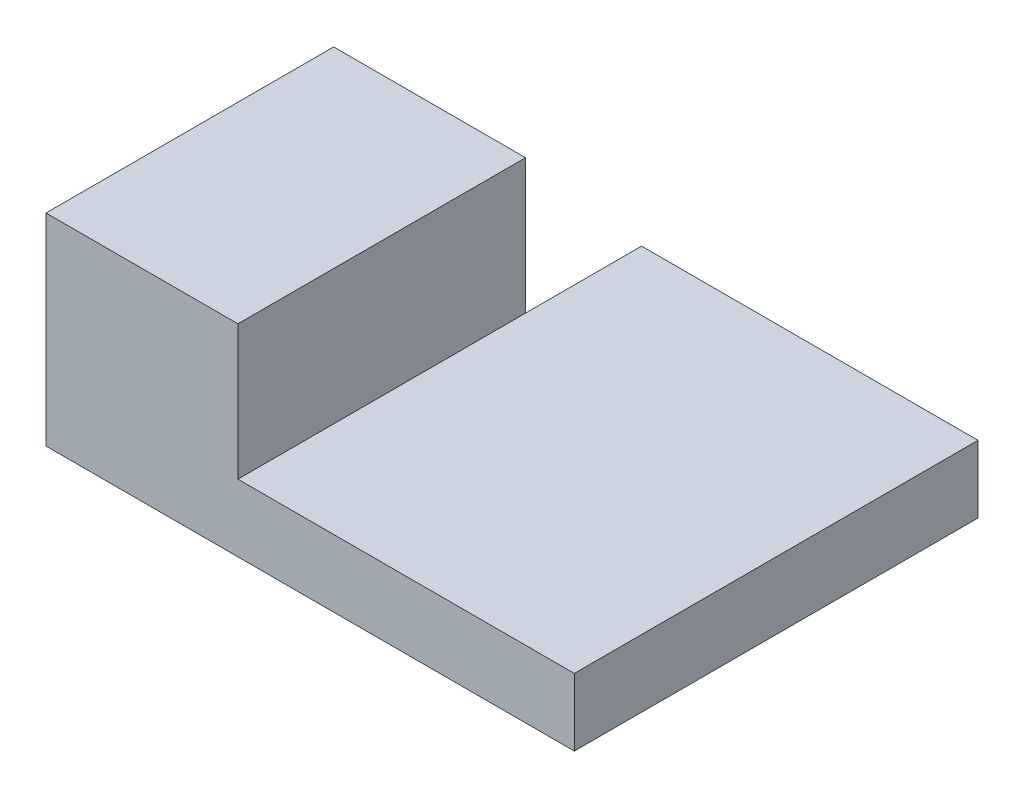
ISO-10303-21;
HEADER;
FILE_DESCRIPTION(('STEP AP214'),'2;1');
FILE_NAME('part.step','',(''),(''),'','','');
FILE_SCHEMA(('AUTOMOTIVE_DESIGN { 1 0 10303 214 1 1 1 1 }'));
ENDSEC;
DATA;
#1=APPLICATION_CONTEXT('core data for automotive mechanical design processes');
#2=APPLICATION_PROTOCOL_DEFINITION('international standard','automotive_design',2000,#1);
#3=PRODUCT_CONTEXT('',#1,'mechanical');
#4=PRODUCT('Part','Part','',(#3));
#5=PRODUCT_RELATED_PRODUCT_CATEGORY('part','',(#4));
#6=PRODUCT_DEFINITION_FORMATION('','',#4);
#7=PRODUCT_DEFINITION_CONTEXT('part definition',#1,'design');
#8=PRODUCT_DEFINITION('design','',#6,#7);
#9=PRODUCT_DEFINITION_SHAPE('','',#8);
#10=(LENGTH_UNIT() NAMED_UNIT(*) SI_UNIT(.MILLI.,.METRE.));
#11=(NAMED_UNIT(*) PLANE_ANGLE_UNIT() SI_UNIT($,.RADIAN.));
#12=(NAMED_UNIT(*) SI_UNIT($,.STERADIAN.) SOLID_ANGLE_UNIT());
#13=UNCERTAINTY_MEASURE_WITH_UNIT(LENGTH_MEASURE(1.E-05),#10,'distance_accuracy_value','');
#14=(GEOMETRIC_REPRESENTATION_CONTEXT(3) GLOBAL_UNCERTAINTY_ASSIGNED_CONTEXT((#13)) GLOBAL_UNIT_ASSIGNED_CONTEXT((#10,
#11,#12)) REPRESENTATION_CONTEXT('',''));
#15=CARTESIAN_POINT('',(0.,0.,0.));
#16=DIRECTION('',(0.,0.,1.));
#17=DIRECTION('',(1.,0.,0.));
#18=AXIS2_PLACEMENT_3D('',#15,#16,#17);
#19=CARTESIAN_POINT('',(-24.9999999999999,10.,0.));
#20=DIRECTION('',(1.,0.,0.));
#21=DIRECTION('',(0.,0.,-1.));
#22=AXIS2_PLACEMENT_3D('',#19,#20,#21);
#23=PLANE('',#22);
#24=DIRECTION('',(0.,-1.,0.));
#25=VECTOR('',#24,1.);
#26=CARTESIAN_POINT('',(-24.9999999999999,30.,-12.75460812292));
#27=LINE('',#26,#25);
#28=CARTESIAN_POINT('',(-24.9999999999999,10.,-12.75460812292));
#29=VERTEX_POINT('',#28);
#30=CARTESIAN_POINT('',(-24.9999999999999,0.,-12.75460812292));
#31=VERTEX_POINT('',#30);
#32=EDGE_CURVE('E11',#29,#31,#27,.T.);
#33=ORIENTED_EDGE('',*,*,#32,.F.);
#34=DIRECTION('',(0.,0.,1.));
#35=VECTOR('',#34,1.);
#36=CARTESIAN_POINT('',(-24.9999999999999,10.,0.));
#37=LINE('',#36,#35);
#38=CARTESIAN_POINT('',(-24.9999999999999,10.,-29.9999999999997));
#39=VERTEX_POINT('',#38);
#40=EDGE_CURVE('E144',#39,#29,#37,.T.);
#41=ORIENTED_EDGE('',*,*,#40,.F.);
#42=DIRECTION('',(0.,-1.,0.));
#43=VECTOR('',#42,1.);
#44=CARTESIAN_POINT('',(-24.9999999999999,10.,-29.9999999999997));
#45=LINE('',#44,#43);
#46=CARTESIAN_POINT('',(-24.9999999999999,0.,-29.9999999999997));
#47=VERTEX_POINT('',#46);
#48=EDGE_CURVE('E152',#39,#47,#45,.T.);
#49=ORIENTED_EDGE('',*,*,#48,.T.);
#50=DIRECTION('',(0.,0.,1.));
#51=VECTOR('',#50,1.);
#52=CARTESIAN_POINT('',(-24.9999999999999,0.,0.));
#53=LINE('',#52,#51);
#54=EDGE_CURVE('E149',#47,#31,#53,.T.);
#55=ORIENTED_EDGE('',*,*,#54,.T.);
#56=EDGE_LOOP('',(#33,#41,#49,#55));
#57=FACE_BOUND('',#56,.T.);
#58=ADVANCED_FACE('F32',(#57),#23,.F.);
#59=CARTESIAN_POINT('',(24.9999999999999,10.,0.));
#60=DIRECTION('',(1.,0.,0.));
#61=DIRECTION('',(0.,0.,-1.));
#62=AXIS2_PLACEMENT_3D('',#59,#60,#61);
#63=PLANE('',#62);
#64=DIRECTION('',(0.,0.,1.));
#65=VECTOR('',#64,1.);
#66=CARTESIAN_POINT('',(24.9999999999999,0.,0.));
#67=LINE('',#66,#65);
#68=CARTESIAN_POINT('',(24.9999999999999,0.,-29.9999999999997));
#69=VERTEX_POINT('',#68);
#70=CARTESIAN_POINT('',(24.9999999999999,0.,29.9999999999999));
#71=VERTEX_POINT('',#70);
#72=EDGE_CURVE('E128',#69,#71,#67,.T.);
#73=ORIENTED_EDGE('',*,*,#72,.F.);
#74=DIRECTION('',(0.,-1.,0.));
#75=VECTOR('',#74,1.);
#76=CARTESIAN_POINT('',(24.9999999999999,10.,-29.9999999999997));
#77=LINE('',#76,#75);
#78=CARTESIAN_POINT('',(24.9999999999999,10.,-29.9999999999997));
#79=VERTEX_POINT('',#78);
#80=EDGE_CURVE('E36',#79,#69,#77,.T.);
#81=ORIENTED_EDGE('',*,*,#80,.F.);
#82=DIRECTION('',(0.,0.,1.));
#83=VECTOR('',#82,1.);
#84=CARTESIAN_POINT('',(24.9999999999999,10.,0.));
#85=LINE('',#84,#83);
#86=CARTESIAN_POINT('',(24.9999999999999,10.,29.9999999999999));
#87=VERTEX_POINT('',#86);
#88=EDGE_CURVE('E137',#79,#87,#85,.T.);
#89=ORIENTED_EDGE('',*,*,#88,.T.);
#90=DIRECTION('',(0.,-1.,0.));
#91=VECTOR('',#90,1.);
#92=CARTESIAN_POINT('',(24.9999999999999,10.,29.9999999999999));
#93=LINE('',#92,#91);
#94=EDGE_CURVE('E74',#87,#71,#93,.T.);
#95=ORIENTED_EDGE('',*,*,#94,.T.);
#96=EDGE_LOOP('',(#73,#81,#89,#95));
#97=FACE_BOUND('',#96,.T.);
#98=ADVANCED_FACE('F34',(#97),#63,.T.);
#99=CARTESIAN_POINT('',(0.,10.,-29.9999999999997));
#100=DIRECTION('',(0.,0.,-1.));
#101=DIRECTION('',(-1.,0.,0.));
#102=AXIS2_PLACEMENT_3D('',#99,#100,#101);
#103=PLANE('',#102);
#104=DIRECTION('',(1.,0.,0.));
#105=VECTOR('',#104,1.);
#106=CARTESIAN_POINT('',(0.,0.,-29.9999999999997));
#107=LINE('',#106,#105);
#108=EDGE_CURVE('E131',#47,#69,#107,.T.);
#109=ORIENTED_EDGE('',*,*,#108,.F.);
#110=ORIENTED_EDGE('',*,*,#48,.F.);
#111=DIRECTION('',(1.,0.,0.));
#112=VECTOR('',#111,1.);
#113=CARTESIAN_POINT('',(0.,10.,-29.9999999999997));
#114=LINE('',#113,#112);
#115=EDGE_CURVE('E139',#39,#79,#114,.T.);
#116=ORIENTED_EDGE('',*,*,#115,.T.);
#117=ORIENTED_EDGE('',*,*,#80,.T.);
#118=EDGE_LOOP('',(#109,#110,#116,#117));
#119=FACE_BOUND('',#118,.T.);
#120=ADVANCED_FACE('F156',(#119),#103,.T.);
#121=CARTESIAN_POINT('',(0.,10.,29.9999999999999));
#122=DIRECTION('',(0.,0.,-1.));
#123=DIRECTION('',(-1.,0.,0.));
#124=AXIS2_PLACEMENT_3D('',#121,#122,#123);
#125=PLANE('',#124);
#126=DIRECTION('',(1.,0.,0.));
#127=VECTOR('',#126,1.);
#128=CARTESIAN_POINT('',(0.,0.,29.9999999999999));
#129=LINE('',#128,#127);
#130=CARTESIAN_POINT('',(-53.5220655623872,0.,29.9999999999999));
#131=VERTEX_POINT('',#130);
#132=EDGE_CURVE('E140',#131,#71,#129,.T.);
#133=ORIENTED_EDGE('',*,*,#132,.T.);
#134=ORIENTED_EDGE('',*,*,#94,.F.);
#135=DIRECTION('',(1.,0.,0.));
#136=VECTOR('',#135,1.);
#137=CARTESIAN_POINT('',(0.,10.,29.9999999999999));
#138=LINE('',#137,#136);
#139=CARTESIAN_POINT('',(-24.9999999999999,10.,29.9999999999999));
#140=VERTEX_POINT('',#139);
#141=EDGE_CURVE('E56',#140,#87,#138,.T.);
#142=ORIENTED_EDGE('',*,*,#141,.F.);
#143=DIRECTION('',(0.,-1.,0.));
#144=VECTOR('',#143,1.);
#145=CARTESIAN_POINT('',(-24.9999999999999,30.,29.9999999999999));
#146=LINE('',#145,#144);
#147=CARTESIAN_POINT('',(-24.9999999999999,30.,29.9999999999999));
#148=VERTEX_POINT('',#147);
#149=EDGE_CURVE('E133',#148,#140,#146,.T.);
#150=ORIENTED_EDGE('',*,*,#149,.F.);
#151=DIRECTION('',(-1.,0.,0.));
#152=VECTOR('',#151,1.);
#153=CARTESIAN_POINT('',(0.,30.,29.9999999999999));
#154=LINE('',#153,#152);
#155=CARTESIAN_POINT('',(-53.5220655623872,30.,29.9999999999999));
#156=VERTEX_POINT('',#155);
#157=EDGE_CURVE('E113',#148,#156,#154,.T.);
#158=ORIENTED_EDGE('',*,*,#157,.T.);
#159=DIRECTION('',(0.,-1.,0.));
#160=VECTOR('',#159,1.);
#161=CARTESIAN_POINT('',(-53.5220655623872,30.,29.9999999999999));
#162=LINE('',#161,#160);
#163=EDGE_CURVE('E109',#156,#131,#162,.T.);
#164=ORIENTED_EDGE('',*,*,#163,.T.);
#165=EDGE_LOOP('',(#133,#134,#142,#150,#158,#164));
#166=FACE_BOUND('',#165,.T.);
#167=ADVANCED_FACE('F168',(#166),#125,.F.);
#168=CARTESIAN_POINT('',(0.,10.,0.));
#169=DIRECTION('',(0.,1.,0.));
#170=DIRECTION('',(0.,0.,1.));
#171=AXIS2_PLACEMENT_3D('',#168,#169,#170);
#172=PLANE('',#171);
#173=ORIENTED_EDGE('',*,*,#88,.F.);
#174=ORIENTED_EDGE('',*,*,#115,.F.);
#175=ORIENTED_EDGE('',*,*,#40,.T.);
#176=EDGE_CURVE('E143',#29,#140,#37,.T.);
#177=ORIENTED_EDGE('',*,*,#176,.T.);
#178=ORIENTED_EDGE('',*,*,#141,.T.);
#179=EDGE_LOOP('',(#173,#174,#175,#177,#178));
#180=FACE_BOUND('',#179,.T.);
#181=ADVANCED_FACE('F170',(#180),#172,.T.);
#182=CARTESIAN_POINT('',(0.,0.,0.));
#183=DIRECTION('',(0.,1.,0.));
#184=DIRECTION('',(0.,0.,1.));
#185=AXIS2_PLACEMENT_3D('',#182,#183,#184);
#186=PLANE('',#185);
#187=ORIENTED_EDGE('',*,*,#72,.T.);
#188=ORIENTED_EDGE('',*,*,#132,.F.);
#189=DIRECTION('',(0.,0.,1.));
#190=VECTOR('',#189,1.);
#191=CARTESIAN_POINT('',(-53.5220655623872,0.,0.));
#192=LINE('',#191,#190);
#193=CARTESIAN_POINT('',(-53.5220655623872,0.,-12.75460812292));
#194=VERTEX_POINT('',#193);
#195=EDGE_CURVE('E123',#194,#131,#192,.T.);
#196=ORIENTED_EDGE('',*,*,#195,.F.);
#197=DIRECTION('',(-1.,0.,0.));
#198=VECTOR('',#197,1.);
#199=CARTESIAN_POINT('',(0.,0.,-12.75460812292));
#200=LINE('',#199,#198);
#201=EDGE_CURVE('E127',#31,#194,#200,.T.);
#202=ORIENTED_EDGE('',*,*,#201,.F.);
#203=ORIENTED_EDGE('',*,*,#54,.F.);
#204=ORIENTED_EDGE('',*,*,#108,.T.);
#205=EDGE_LOOP('',(#187,#188,#196,#202,#203,#204));
#206=FACE_BOUND('',#205,.T.);
#207=ADVANCED_FACE('F159',(#206),#186,.F.);
#208=CARTESIAN_POINT('',(-24.9999999999999,30.,0.));
#209=DIRECTION('',(1.,0.,0.));
#210=DIRECTION('',(0.,0.,-1.));
#211=AXIS2_PLACEMENT_3D('',#208,#209,#210);
#212=PLANE('',#211);
#213=ORIENTED_EDGE('',*,*,#176,.F.);
#214=CARTESIAN_POINT('',(-24.9999999999999,30.,-12.75460812292));
#215=VERTEX_POINT('',#214);
#216=EDGE_CURVE('E42',#215,#29,#27,.T.);
#217=ORIENTED_EDGE('',*,*,#216,.F.);
#218=DIRECTION('',(0.,0.,1.));
#219=VECTOR('',#218,1.);
#220=CARTESIAN_POINT('',(-24.9999999999999,30.,0.));
#221=LINE('',#220,#219);
#222=EDGE_CURVE('E120',#215,#148,#221,.T.);
#223=ORIENTED_EDGE('',*,*,#222,.T.);
#224=ORIENTED_EDGE('',*,*,#149,.T.);
#225=EDGE_LOOP('',(#213,#217,#223,#224));
#226=FACE_BOUND('',#225,.T.);
#227=ADVANCED_FACE('F169',(#226),#212,.T.);
#228=CARTESIAN_POINT('',(0.,30.,-12.75460812292));
#229=DIRECTION('',(0.,0.,1.));
#230=DIRECTION('',(1.,0.,0.));
#231=AXIS2_PLACEMENT_3D('',#228,#229,#230);
#232=PLANE('',#231);
#233=ORIENTED_EDGE('',*,*,#201,.T.);
#234=DIRECTION('',(0.,-1.,0.));
#235=VECTOR('',#234,1.);
#236=CARTESIAN_POINT('',(-53.5220655623872,30.,-12.75460812292));
#237=LINE('',#236,#235);
#238=CARTESIAN_POINT('',(-53.5220655623872,30.,-12.75460812292));
#239=VERTEX_POINT('',#238);
#240=EDGE_CURVE('E106',#239,#194,#237,.T.);
#241=ORIENTED_EDGE('',*,*,#240,.F.);
#242=DIRECTION('',(-1.,0.,0.));
#243=VECTOR('',#242,1.);
#244=CARTESIAN_POINT('',(0.,30.,-12.75460812292));
#245=LINE('',#244,#243);
#246=EDGE_CURVE('E114',#215,#239,#245,.T.);
#247=ORIENTED_EDGE('',*,*,#246,.F.);
#248=ORIENTED_EDGE('',*,*,#216,.T.);
#249=ORIENTED_EDGE('',*,*,#32,.T.);
#250=EDGE_LOOP('',(#233,#241,#247,#248,#249));
#251=FACE_BOUND('',#250,.T.);
#252=ADVANCED_FACE('F125',(#251),#232,.F.);
#253=CARTESIAN_POINT('',(-53.5220655623872,30.,0.));
#254=DIRECTION('',(1.,0.,0.));
#255=DIRECTION('',(0.,0.,-1.));
#256=AXIS2_PLACEMENT_3D('',#253,#254,#255);
#257=PLANE('',#256);
#258=ORIENTED_EDGE('',*,*,#195,.T.);
#259=ORIENTED_EDGE('',*,*,#163,.F.);
#260=DIRECTION('',(0.,0.,1.));
#261=VECTOR('',#260,1.);
#262=CARTESIAN_POINT('',(-53.5220655623872,30.,0.));
#263=LINE('',#262,#261);
#264=EDGE_CURVE('E101',#239,#156,#263,.T.);
#265=ORIENTED_EDGE('',*,*,#264,.F.);
#266=ORIENTED_EDGE('',*,*,#240,.T.);
#267=EDGE_LOOP('',(#258,#259,#265,#266));
#268=FACE_BOUND('',#267,.T.);
#269=ADVANCED_FACE('F104',(#268),#257,.F.);
#270=CARTESIAN_POINT('',(0.,30.,0.));
#271=DIRECTION('',(0.,1.,0.));
#272=DIRECTION('',(0.,0.,1.));
#273=AXIS2_PLACEMENT_3D('',#270,#271,#272);
#274=PLANE('',#273);
#275=ORIENTED_EDGE('',*,*,#246,.T.);
#276=ORIENTED_EDGE('',*,*,#264,.T.);
#277=ORIENTED_EDGE('',*,*,#157,.F.);
#278=ORIENTED_EDGE('',*,*,#222,.F.);
#279=EDGE_LOOP('',(#275,#276,#277,#278));
#280=FACE_BOUND('',#279,.T.);
#281=ADVANCED_FACE('F118',(#280),#274,.T.);
#282=CLOSED_SHELL('',(#58,#98,#120,#167,#181,#207,#227,#252,#269,#281));
#283=MANIFOLD_SOLID_BREP('B2',#282);
#284=ADVANCED_BREP_SHAPE_REPRESENTATION('',(#18,#283),#14);
#285=SHAPE_DEFINITION_REPRESENTATION(#9,#284);
ENDSEC;
END-ISO-10303-21;
